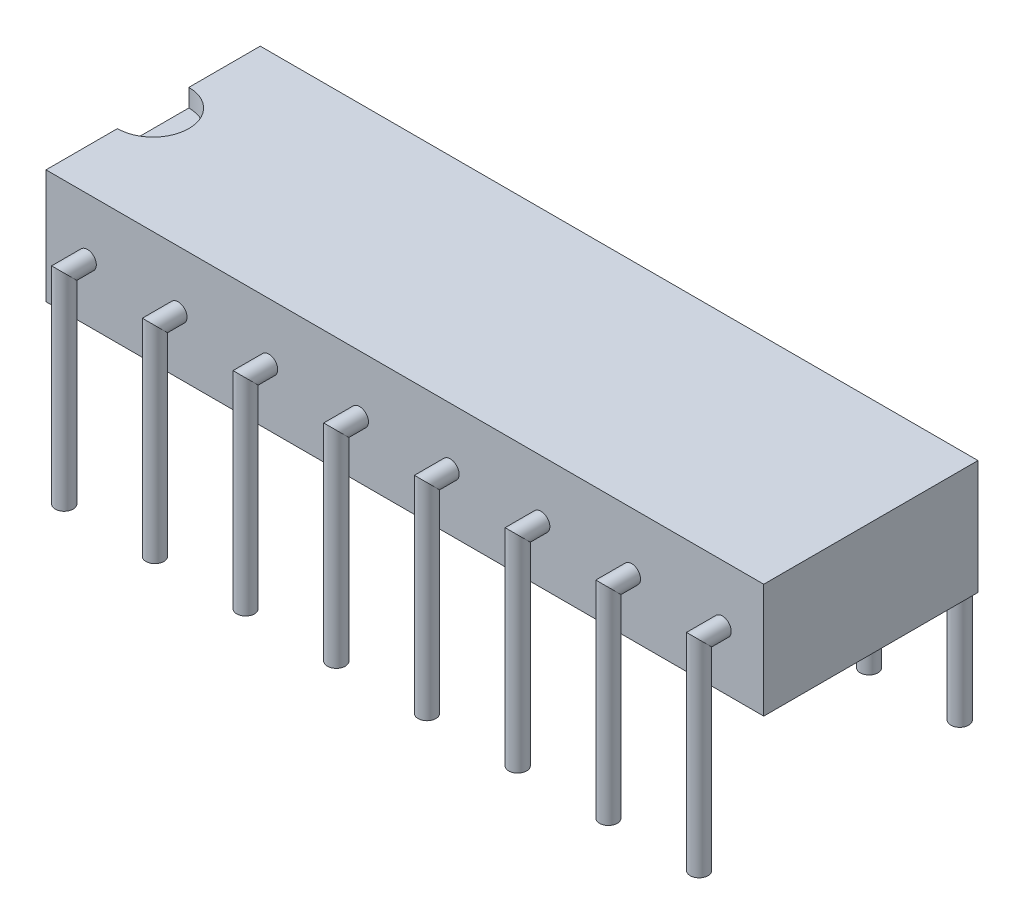
ISO-10303-21;
HEADER;
FILE_DESCRIPTION(('STEP AP214'),'2;1');
FILE_NAME('part.step','',(''),(''),'','','');
FILE_SCHEMA(('AUTOMOTIVE_DESIGN { 1 0 10303 214 1 1 1 1 }'));
ENDSEC;
DATA;
#1=APPLICATION_CONTEXT('core data for automotive mechanical design processes');
#2=APPLICATION_PROTOCOL_DEFINITION('international standard','automotive_design',2000,#1);
#3=PRODUCT_CONTEXT('',#1,'mechanical');
#4=PRODUCT('Part','Part','',(#3));
#5=PRODUCT_RELATED_PRODUCT_CATEGORY('part','',(#4));
#6=PRODUCT_DEFINITION_FORMATION('','',#4);
#7=PRODUCT_DEFINITION_CONTEXT('part definition',#1,'design');
#8=PRODUCT_DEFINITION('design','',#6,#7);
#9=PRODUCT_DEFINITION_SHAPE('','',#8);
#10=(LENGTH_UNIT() NAMED_UNIT(*) SI_UNIT(.MILLI.,.METRE.));
#11=(NAMED_UNIT(*) PLANE_ANGLE_UNIT() SI_UNIT($,.RADIAN.));
#12=(NAMED_UNIT(*) SI_UNIT($,.STERADIAN.) SOLID_ANGLE_UNIT());
#13=UNCERTAINTY_MEASURE_WITH_UNIT(LENGTH_MEASURE(1.E-05),#10,'distance_accuracy_value','');
#14=(GEOMETRIC_REPRESENTATION_CONTEXT(3) GLOBAL_UNCERTAINTY_ASSIGNED_CONTEXT((#13)) GLOBAL_UNIT_ASSIGNED_CONTEXT((#10,
#11,#12)) REPRESENTATION_CONTEXT('',''));
#15=CARTESIAN_POINT('',(0.,0.,0.));
#16=DIRECTION('',(0.,0.,1.));
#17=DIRECTION('',(1.,0.,0.));
#18=AXIS2_PLACEMENT_3D('',#15,#16,#17);
#19=CARTESIAN_POINT('',(20.1,3.2,3.));
#20=DIRECTION('',(0.,0.,-1.));
#21=DIRECTION('',(-1.,0.,0.));
#22=AXIS2_PLACEMENT_3D('',#19,#20,#21);
#23=PLANE('',#22);
#24=CARTESIAN_POINT('',(16.4,1.6,3.));
#25=DIRECTION('',(0.,0.,-1.));
#26=DIRECTION('',(-1.,0.,0.));
#27=AXIS2_PLACEMENT_3D('',#24,#25,#26);
#28=CIRCLE('',#27,0.25);
#29=CARTESIAN_POINT('',(16.15,1.6,3.));
#30=VERTEX_POINT('',#29);
#31=EDGE_CURVE('E51',#30,#30,#28,.F.);
#32=ORIENTED_EDGE('',*,*,#31,.F.);
#33=EDGE_LOOP('',(#32));
#34=FACE_BOUND('',#33,.T.);
#35=CARTESIAN_POINT('',(11.32,1.6,3.));
#36=DIRECTION('',(0.,0.,-1.));
#37=DIRECTION('',(-1.,0.,0.));
#38=AXIS2_PLACEMENT_3D('',#35,#36,#37);
#39=CIRCLE('',#38,0.25);
#40=CARTESIAN_POINT('',(11.07,1.6,3.));
#41=VERTEX_POINT('',#40);
#42=EDGE_CURVE('E154',#41,#41,#39,.F.);
#43=ORIENTED_EDGE('',*,*,#42,.F.);
#44=EDGE_LOOP('',(#43));
#45=FACE_BOUND('',#44,.T.);
#46=CARTESIAN_POINT('',(6.24,1.6,3.));
#47=DIRECTION('',(0.,0.,-1.));
#48=DIRECTION('',(-1.,0.,0.));
#49=AXIS2_PLACEMENT_3D('',#46,#47,#48);
#50=CIRCLE('',#49,0.25);
#51=CARTESIAN_POINT('',(5.99,1.6,3.));
#52=VERTEX_POINT('',#51);
#53=EDGE_CURVE('E148',#52,#52,#50,.F.);
#54=ORIENTED_EDGE('',*,*,#53,.F.);
#55=EDGE_LOOP('',(#54));
#56=FACE_BOUND('',#55,.T.);
#57=CARTESIAN_POINT('',(1.16,1.6,3.));
#58=DIRECTION('',(0.,0.,-1.));
#59=DIRECTION('',(-1.,0.,0.));
#60=AXIS2_PLACEMENT_3D('',#57,#58,#59);
#61=CIRCLE('',#60,0.25);
#62=CARTESIAN_POINT('',(0.91,1.6,3.));
#63=VERTEX_POINT('',#62);
#64=EDGE_CURVE('E142',#63,#63,#61,.F.);
#65=ORIENTED_EDGE('',*,*,#64,.F.);
#66=EDGE_LOOP('',(#65));
#67=FACE_BOUND('',#66,.T.);
#68=DIRECTION('',(0.,-1.,0.));
#69=VECTOR('',#68,1.);
#70=CARTESIAN_POINT('',(0.,3.2,3.));
#71=LINE('',#70,#69);
#72=CARTESIAN_POINT('',(0.,3.2,3.));
#73=VERTEX_POINT('',#72);
#74=CARTESIAN_POINT('',(0.,0.,3.));
#75=VERTEX_POINT('',#74);
#76=EDGE_CURVE('E178',#73,#75,#71,.T.);
#77=ORIENTED_EDGE('',*,*,#76,.T.);
#78=DIRECTION('',(-1.,0.,0.));
#79=VECTOR('',#78,1.);
#80=CARTESIAN_POINT('',(20.1,0.,3.));
#81=LINE('',#80,#79);
#82=CARTESIAN_POINT('',(20.1,0.,3.));
#83=VERTEX_POINT('',#82);
#84=EDGE_CURVE('E139',#83,#75,#81,.T.);
#85=ORIENTED_EDGE('',*,*,#84,.F.);
#86=DIRECTION('',(0.,-1.,0.));
#87=VECTOR('',#86,1.);
#88=CARTESIAN_POINT('',(20.1,3.2,3.));
#89=LINE('',#88,#87);
#90=CARTESIAN_POINT('',(20.1,3.2,3.));
#91=VERTEX_POINT('',#90);
#92=EDGE_CURVE('E119',#91,#83,#89,.T.);
#93=ORIENTED_EDGE('',*,*,#92,.F.);
#94=DIRECTION('',(-1.,0.,0.));
#95=VECTOR('',#94,1.);
#96=CARTESIAN_POINT('',(20.1,3.2,3.));
#97=LINE('',#96,#95);
#98=EDGE_CURVE('E132',#91,#73,#97,.T.);
#99=ORIENTED_EDGE('',*,*,#98,.T.);
#100=EDGE_LOOP('',(#77,#85,#93,#99));
#101=FACE_BOUND('',#100,.T.);
#102=CARTESIAN_POINT('',(3.7,1.6,3.));
#103=DIRECTION('',(0.,0.,-1.));
#104=DIRECTION('',(-1.,0.,0.));
#105=AXIS2_PLACEMENT_3D('',#102,#103,#104);
#106=CIRCLE('',#105,0.25);
#107=CARTESIAN_POINT('',(3.45,1.6,3.));
#108=VERTEX_POINT('',#107);
#109=EDGE_CURVE('E145',#108,#108,#106,.F.);
#110=ORIENTED_EDGE('',*,*,#109,.F.);
#111=EDGE_LOOP('',(#110));
#112=FACE_BOUND('',#111,.T.);
#113=CARTESIAN_POINT('',(8.78,1.6,3.));
#114=DIRECTION('',(0.,0.,-1.));
#115=DIRECTION('',(-1.,0.,0.));
#116=AXIS2_PLACEMENT_3D('',#113,#114,#115);
#117=CIRCLE('',#116,0.25);
#118=CARTESIAN_POINT('',(8.53,1.6,3.));
#119=VERTEX_POINT('',#118);
#120=EDGE_CURVE('E151',#119,#119,#117,.F.);
#121=ORIENTED_EDGE('',*,*,#120,.F.);
#122=EDGE_LOOP('',(#121));
#123=FACE_BOUND('',#122,.T.);
#124=CARTESIAN_POINT('',(13.86,1.6,3.));
#125=DIRECTION('',(0.,0.,-1.));
#126=DIRECTION('',(-1.,0.,0.));
#127=AXIS2_PLACEMENT_3D('',#124,#125,#126);
#128=CIRCLE('',#127,0.25);
#129=CARTESIAN_POINT('',(13.61,1.6,3.));
#130=VERTEX_POINT('',#129);
#131=EDGE_CURVE('E157',#130,#130,#128,.F.);
#132=ORIENTED_EDGE('',*,*,#131,.F.);
#133=EDGE_LOOP('',(#132));
#134=FACE_BOUND('',#133,.T.);
#135=CARTESIAN_POINT('',(18.94,1.6,3.));
#136=DIRECTION('',(0.,0.,-1.));
#137=DIRECTION('',(-1.,0.,0.));
#138=AXIS2_PLACEMENT_3D('',#135,#136,#137);
#139=CIRCLE('',#138,0.25);
#140=CARTESIAN_POINT('',(18.69,1.6,3.));
#141=VERTEX_POINT('',#140);
#142=EDGE_CURVE('E12',#141,#141,#139,.F.);
#143=ORIENTED_EDGE('',*,*,#142,.F.);
#144=EDGE_LOOP('',(#143));
#145=FACE_BOUND('',#144,.T.);
#146=ADVANCED_FACE('F44',(#34,#45,#56,#67,#101,#112,#123,#134,#145),#23,.F.);
#147=CARTESIAN_POINT('',(20.1,0.,3.));
#148=DIRECTION('',(0.,1.,0.));
#149=DIRECTION('',(0.,0.,1.));
#150=AXIS2_PLACEMENT_3D('',#147,#148,#149);
#151=PLANE('',#150);
#152=DIRECTION('',(0.,0.,-1.));
#153=VECTOR('',#152,1.);
#154=CARTESIAN_POINT('',(0.,0.,3.));
#155=LINE('',#154,#153);
#156=CARTESIAN_POINT('',(0.,0.,-3.));
#157=VERTEX_POINT('',#156);
#158=EDGE_CURVE('E260',#75,#157,#155,.T.);
#159=ORIENTED_EDGE('',*,*,#158,.T.);
#160=DIRECTION('',(-1.,0.,0.));
#161=VECTOR('',#160,1.);
#162=CARTESIAN_POINT('',(20.1,0.,-3.));
#163=LINE('',#162,#161);
#164=CARTESIAN_POINT('',(20.1,0.,-3.));
#165=VERTEX_POINT('',#164);
#166=EDGE_CURVE('E136',#165,#157,#163,.T.);
#167=ORIENTED_EDGE('',*,*,#166,.F.);
#168=DIRECTION('',(0.,0.,-1.));
#169=VECTOR('',#168,1.);
#170=CARTESIAN_POINT('',(20.1,0.,3.));
#171=LINE('',#170,#169);
#172=EDGE_CURVE('E122',#83,#165,#171,.T.);
#173=ORIENTED_EDGE('',*,*,#172,.F.);
#174=ORIENTED_EDGE('',*,*,#84,.T.);
#175=EDGE_LOOP('',(#159,#167,#173,#174));
#176=FACE_BOUND('',#175,.T.);
#177=ADVANCED_FACE('F167',(#176),#151,.F.);
#178=CARTESIAN_POINT('',(20.1,3.2,-3.));
#179=DIRECTION('',(0.,0.,1.));
#180=DIRECTION('',(1.,0.,0.));
#181=AXIS2_PLACEMENT_3D('',#178,#179,#180);
#182=PLANE('',#181);
#183=CARTESIAN_POINT('',(18.94,1.6,-3.));
#184=DIRECTION('',(0.,0.,1.));
#185=DIRECTION('',(1.,0.,0.));
#186=AXIS2_PLACEMENT_3D('',#183,#184,#185);
#187=CIRCLE('',#186,0.25);
#188=CARTESIAN_POINT('',(19.19,1.6,-3.));
#189=VERTEX_POINT('',#188);
#190=EDGE_CURVE('E701',#189,#189,#187,.T.);
#191=ORIENTED_EDGE('',*,*,#190,.T.);
#192=EDGE_LOOP('',(#191));
#193=FACE_BOUND('',#192,.T.);
#194=CARTESIAN_POINT('',(16.4,1.6,-3.));
#195=DIRECTION('',(0.,0.,1.));
#196=DIRECTION('',(1.,0.,0.));
#197=AXIS2_PLACEMENT_3D('',#194,#195,#196);
#198=CIRCLE('',#197,0.25);
#199=CARTESIAN_POINT('',(16.65,1.6,-3.));
#200=VERTEX_POINT('',#199);
#201=EDGE_CURVE('E694',#200,#200,#198,.T.);
#202=ORIENTED_EDGE('',*,*,#201,.T.);
#203=EDGE_LOOP('',(#202));
#204=FACE_BOUND('',#203,.T.);
#205=CARTESIAN_POINT('',(13.86,1.6,-3.));
#206=DIRECTION('',(0.,0.,1.));
#207=DIRECTION('',(1.,0.,0.));
#208=AXIS2_PLACEMENT_3D('',#205,#206,#207);
#209=CIRCLE('',#208,0.25);
#210=CARTESIAN_POINT('',(14.11,1.6,-3.));
#211=VERTEX_POINT('',#210);
#212=EDGE_CURVE('E710',#211,#211,#209,.T.);
#213=ORIENTED_EDGE('',*,*,#212,.T.);
#214=EDGE_LOOP('',(#213));
#215=FACE_BOUND('',#214,.T.);
#216=CARTESIAN_POINT('',(11.32,1.6,-3.));
#217=DIRECTION('',(0.,0.,1.));
#218=DIRECTION('',(1.,0.,0.));
#219=AXIS2_PLACEMENT_3D('',#216,#217,#218);
#220=CIRCLE('',#219,0.25);
#221=CARTESIAN_POINT('',(11.57,1.6,-3.));
#222=VERTEX_POINT('',#221);
#223=EDGE_CURVE('E719',#222,#222,#220,.T.);
#224=ORIENTED_EDGE('',*,*,#223,.T.);
#225=EDGE_LOOP('',(#224));
#226=FACE_BOUND('',#225,.T.);
#227=CARTESIAN_POINT('',(8.78,1.6,-3.));
#228=DIRECTION('',(0.,0.,1.));
#229=DIRECTION('',(1.,0.,0.));
#230=AXIS2_PLACEMENT_3D('',#227,#228,#229);
#231=CIRCLE('',#230,0.25);
#232=CARTESIAN_POINT('',(9.03,1.6,-3.));
#233=VERTEX_POINT('',#232);
#234=EDGE_CURVE('E728',#233,#233,#231,.T.);
#235=ORIENTED_EDGE('',*,*,#234,.T.);
#236=EDGE_LOOP('',(#235));
#237=FACE_BOUND('',#236,.T.);
#238=CARTESIAN_POINT('',(6.24,1.6,-3.));
#239=DIRECTION('',(0.,0.,1.));
#240=DIRECTION('',(1.,0.,0.));
#241=AXIS2_PLACEMENT_3D('',#238,#239,#240);
#242=CIRCLE('',#241,0.25);
#243=CARTESIAN_POINT('',(6.49,1.6,-3.));
#244=VERTEX_POINT('',#243);
#245=EDGE_CURVE('E737',#244,#244,#242,.T.);
#246=ORIENTED_EDGE('',*,*,#245,.T.);
#247=EDGE_LOOP('',(#246));
#248=FACE_BOUND('',#247,.T.);
#249=CARTESIAN_POINT('',(3.7,1.6,-3.));
#250=DIRECTION('',(0.,0.,1.));
#251=DIRECTION('',(1.,0.,0.));
#252=AXIS2_PLACEMENT_3D('',#249,#250,#251);
#253=CIRCLE('',#252,0.25);
#254=CARTESIAN_POINT('',(3.95,1.6,-3.));
#255=VERTEX_POINT('',#254);
#256=EDGE_CURVE('E746',#255,#255,#253,.T.);
#257=ORIENTED_EDGE('',*,*,#256,.T.);
#258=EDGE_LOOP('',(#257));
#259=FACE_BOUND('',#258,.T.);
#260=CARTESIAN_POINT('',(1.16,1.6,-3.));
#261=DIRECTION('',(0.,0.,1.));
#262=DIRECTION('',(1.,0.,0.));
#263=AXIS2_PLACEMENT_3D('',#260,#261,#262);
#264=CIRCLE('',#263,0.25);
#265=CARTESIAN_POINT('',(1.41,1.6,-3.));
#266=VERTEX_POINT('',#265);
#267=EDGE_CURVE('E243',#266,#266,#264,.T.);
#268=ORIENTED_EDGE('',*,*,#267,.T.);
#269=EDGE_LOOP('',(#268));
#270=FACE_BOUND('',#269,.T.);
#271=DIRECTION('',(0.,1.,0.));
#272=VECTOR('',#271,1.);
#273=CARTESIAN_POINT('',(0.,3.2,-3.));
#274=LINE('',#273,#272);
#275=CARTESIAN_POINT('',(0.,3.2,-3.));
#276=VERTEX_POINT('',#275);
#277=EDGE_CURVE('E124',#157,#276,#274,.T.);
#278=ORIENTED_EDGE('',*,*,#277,.T.);
#279=DIRECTION('',(-1.,0.,0.));
#280=VECTOR('',#279,1.);
#281=CARTESIAN_POINT('',(20.1,3.2,-3.));
#282=LINE('',#281,#280);
#283=CARTESIAN_POINT('',(20.1,3.2,-3.));
#284=VERTEX_POINT('',#283);
#285=EDGE_CURVE('E118',#284,#276,#282,.T.);
#286=ORIENTED_EDGE('',*,*,#285,.F.);
#287=DIRECTION('',(0.,1.,0.));
#288=VECTOR('',#287,1.);
#289=CARTESIAN_POINT('',(20.1,3.2,-3.));
#290=LINE('',#289,#288);
#291=EDGE_CURVE('E129',#165,#284,#290,.T.);
#292=ORIENTED_EDGE('',*,*,#291,.F.);
#293=ORIENTED_EDGE('',*,*,#166,.T.);
#294=EDGE_LOOP('',(#278,#286,#292,#293));
#295=FACE_BOUND('',#294,.T.);
#296=ADVANCED_FACE('F264',(#193,#204,#215,#226,#237,#248,#259,#270,#295),#182,.F.);
#297=CARTESIAN_POINT('',(20.1,3.2,3.));
#298=DIRECTION('',(0.,-1.,0.));
#299=DIRECTION('',(0.,0.,-1.));
#300=AXIS2_PLACEMENT_3D('',#297,#298,#299);
#301=PLANE('',#300);
#302=DIRECTION('',(0.,0.,1.));
#303=VECTOR('',#302,1.);
#304=CARTESIAN_POINT('',(0.,3.2,3.));
#305=LINE('',#304,#303);
#306=CARTESIAN_POINT('',(0.,3.2,-1.));
#307=VERTEX_POINT('',#306);
#308=EDGE_CURVE('E112',#276,#307,#305,.T.);
#309=ORIENTED_EDGE('',*,*,#308,.T.);
#310=CARTESIAN_POINT('',(0.,3.2,0.));
#311=DIRECTION('',(0.,1.,0.));
#312=DIRECTION('',(0.,0.,1.));
#313=AXIS2_PLACEMENT_3D('',#310,#311,#312);
#314=CIRCLE('',#313,1.);
#315=CARTESIAN_POINT('',(0.,3.2,1.));
#316=VERTEX_POINT('',#315);
#317=EDGE_CURVE('E96',#316,#307,#314,.T.);
#318=ORIENTED_EDGE('',*,*,#317,.F.);
#319=EDGE_CURVE('E120',#316,#73,#305,.T.);
#320=ORIENTED_EDGE('',*,*,#319,.T.);
#321=ORIENTED_EDGE('',*,*,#98,.F.);
#322=DIRECTION('',(0.,0.,1.));
#323=VECTOR('',#322,1.);
#324=CARTESIAN_POINT('',(20.1,3.2,3.));
#325=LINE('',#324,#323);
#326=EDGE_CURVE('E65',#284,#91,#325,.T.);
#327=ORIENTED_EDGE('',*,*,#326,.F.);
#328=ORIENTED_EDGE('',*,*,#285,.T.);
#329=EDGE_LOOP('',(#309,#318,#320,#321,#327,#328));
#330=FACE_BOUND('',#329,.T.);
#331=ADVANCED_FACE('F116',(#330),#301,.F.);
#332=CARTESIAN_POINT('',(20.1,0.,3.));
#333=DIRECTION('',(1.,0.,0.));
#334=DIRECTION('',(0.,0.,-1.));
#335=AXIS2_PLACEMENT_3D('',#332,#333,#334);
#336=PLANE('',#335);
#337=ORIENTED_EDGE('',*,*,#92,.T.);
#338=ORIENTED_EDGE('',*,*,#172,.T.);
#339=ORIENTED_EDGE('',*,*,#291,.T.);
#340=ORIENTED_EDGE('',*,*,#326,.T.);
#341=EDGE_LOOP('',(#337,#338,#339,#340));
#342=FACE_BOUND('',#341,.T.);
#343=ADVANCED_FACE('F267',(#342),#336,.T.);
#344=CARTESIAN_POINT('',(0.,0.,3.));
#345=DIRECTION('',(1.,0.,0.));
#346=DIRECTION('',(0.,0.,-1.));
#347=AXIS2_PLACEMENT_3D('',#344,#345,#346);
#348=PLANE('',#347);
#349=DIRECTION('',(0.,0.,1.));
#350=VECTOR('',#349,1.);
#351=CARTESIAN_POINT('',(0.,2.7,-1.));
#352=LINE('',#351,#350);
#353=CARTESIAN_POINT('',(0.,2.7,-1.));
#354=VERTEX_POINT('',#353);
#355=CARTESIAN_POINT('',(0.,2.7,1.));
#356=VERTEX_POINT('',#355);
#357=EDGE_CURVE('E113',#354,#356,#352,.T.);
#358=ORIENTED_EDGE('',*,*,#357,.F.);
#359=DIRECTION('',(0.,1.,0.));
#360=VECTOR('',#359,1.);
#361=CARTESIAN_POINT('',(0.,2.7,-1.));
#362=LINE('',#361,#360);
#363=EDGE_CURVE('E99',#354,#307,#362,.T.);
#364=ORIENTED_EDGE('',*,*,#363,.T.);
#365=ORIENTED_EDGE('',*,*,#308,.F.);
#366=ORIENTED_EDGE('',*,*,#277,.F.);
#367=ORIENTED_EDGE('',*,*,#158,.F.);
#368=ORIENTED_EDGE('',*,*,#76,.F.);
#369=ORIENTED_EDGE('',*,*,#319,.F.);
#370=DIRECTION('',(0.,1.,0.));
#371=VECTOR('',#370,1.);
#372=CARTESIAN_POINT('',(0.,2.7,1.));
#373=LINE('',#372,#371);
#374=EDGE_CURVE('E102',#356,#316,#373,.T.);
#375=ORIENTED_EDGE('',*,*,#374,.F.);
#376=EDGE_LOOP('',(#358,#364,#365,#366,#367,#368,#369,#375));
#377=FACE_BOUND('',#376,.T.);
#378=ADVANCED_FACE('F110',(#377),#348,.F.);
#379=CARTESIAN_POINT('',(0.,2.7,0.));
#380=DIRECTION('',(0.,1.,0.));
#381=DIRECTION('',(0.,0.,1.));
#382=AXIS2_PLACEMENT_3D('',#379,#380,#381);
#383=CYLINDRICAL_SURFACE('',#382,1.);
#384=ORIENTED_EDGE('',*,*,#317,.T.);
#385=ORIENTED_EDGE('',*,*,#363,.F.);
#386=CARTESIAN_POINT('',(0.,2.7,0.));
#387=DIRECTION('',(0.,1.,0.));
#388=DIRECTION('',(0.,0.,1.));
#389=AXIS2_PLACEMENT_3D('',#386,#387,#388);
#390=CIRCLE('',#389,1.);
#391=EDGE_CURVE('E57',#356,#354,#390,.T.);
#392=ORIENTED_EDGE('',*,*,#391,.F.);
#393=ORIENTED_EDGE('',*,*,#374,.T.);
#394=EDGE_LOOP('',(#384,#385,#392,#393));
#395=FACE_BOUND('',#394,.T.);
#396=ADVANCED_FACE('F98',(#395),#383,.F.);
#397=CARTESIAN_POINT('',(0.,2.7,0.));
#398=DIRECTION('',(0.,1.,0.));
#399=DIRECTION('',(0.,0.,1.));
#400=AXIS2_PLACEMENT_3D('',#397,#398,#399);
#401=PLANE('',#400);
#402=ORIENTED_EDGE('',*,*,#391,.T.);
#403=ORIENTED_EDGE('',*,*,#357,.T.);
#404=EDGE_LOOP('',(#402,#403));
#405=FACE_BOUND('',#404,.T.);
#406=ADVANCED_FACE('F305',(#405),#401,.T.);
#407=CARTESIAN_POINT('',(1.16,1.6,3.65));
#408=DIRECTION('',(0.,-1.,0.));
#409=DIRECTION('',(0.,0.,-1.));
#410=AXIS2_PLACEMENT_3D('',#407,#408,#409);
#411=CYLINDRICAL_SURFACE('',#410,0.25);
#412=CARTESIAN_POINT('',(1.16,1.6,3.65));
#413=DIRECTION('',(0.,-0.707106781186548,0.707106781186547));
#414=DIRECTION('',(0.,-0.707106781186547,-0.707106781186548));
#415=AXIS2_PLACEMENT_3D('',#412,#413,#414);
#416=ELLIPSE('',#415,0.353553390593274,0.25);
#417=CARTESIAN_POINT('',(1.16,1.35,3.4));
#418=VERTEX_POINT('',#417);
#419=EDGE_CURVE('E252',#418,#418,#416,.T.);
#420=ORIENTED_EDGE('',*,*,#419,.T.);
#421=EDGE_LOOP('',(#420));
#422=FACE_BOUND('',#421,.T.);
#423=CARTESIAN_POINT('',(1.16,-4.,3.65));
#424=DIRECTION('',(0.,-1.,0.));
#425=DIRECTION('',(0.,0.,-1.));
#426=AXIS2_PLACEMENT_3D('',#423,#424,#425);
#427=CIRCLE('',#426,0.25);
#428=CARTESIAN_POINT('',(1.16,-4.,3.4));
#429=VERTEX_POINT('',#428);
#430=EDGE_CURVE('E106',#429,#429,#427,.F.);
#431=ORIENTED_EDGE('',*,*,#430,.T.);
#432=EDGE_LOOP('',(#431));
#433=FACE_BOUND('',#432,.T.);
#434=ADVANCED_FACE('F311',(#422,#433),#411,.T.);
#435=CARTESIAN_POINT('',(1.16,1.6,4.35710678118655));
#436=DIRECTION('',(0.,0.,-1.));
#437=DIRECTION('',(0.,1.,0.));
#438=AXIS2_PLACEMENT_3D('',#435,#436,#437);
#439=CYLINDRICAL_SURFACE('',#438,0.25);
#440=ORIENTED_EDGE('',*,*,#64,.T.);
#441=EDGE_LOOP('',(#440));
#442=FACE_BOUND('',#441,.T.);
#443=ORIENTED_EDGE('',*,*,#419,.F.);
#444=EDGE_LOOP('',(#443));
#445=FACE_BOUND('',#444,.T.);
#446=ADVANCED_FACE('F318',(#442,#445),#439,.T.);
#447=CARTESIAN_POINT('',(1.16,-4.,3.65));
#448=DIRECTION('',(0.,-1.,0.));
#449=DIRECTION('',(0.,0.,-1.));
#450=AXIS2_PLACEMENT_3D('',#447,#448,#449);
#451=PLANE('',#450);
#452=ORIENTED_EDGE('',*,*,#430,.F.);
#453=EDGE_LOOP('',(#452));
#454=FACE_BOUND('',#453,.T.);
#455=ADVANCED_FACE('F326',(#454),#451,.T.);
#456=CARTESIAN_POINT('',(1.16,1.6,-3.65));
#457=DIRECTION('',(0.,-1.,0.));
#458=DIRECTION('',(0.,0.,-1.));
#459=AXIS2_PLACEMENT_3D('',#456,#457,#458);
#460=CYLINDRICAL_SURFACE('',#459,0.25);
#461=CARTESIAN_POINT('',(1.16,1.6,-3.65));
#462=DIRECTION('',(0.,-0.707106781186548,-0.707106781186547));
#463=DIRECTION('',(0.,-0.707106781186547,0.707106781186548));
#464=AXIS2_PLACEMENT_3D('',#461,#462,#463);
#465=ELLIPSE('',#464,0.353553390593274,0.25);
#466=CARTESIAN_POINT('',(1.16,1.35,-3.4));
#467=VERTEX_POINT('',#466);
#468=EDGE_CURVE('E246',#467,#467,#465,.F.);
#469=ORIENTED_EDGE('',*,*,#468,.F.);
#470=EDGE_LOOP('',(#469));
#471=FACE_BOUND('',#470,.T.);
#472=CARTESIAN_POINT('',(1.16,-4.,-3.65));
#473=DIRECTION('',(0.,-1.,0.));
#474=DIRECTION('',(0.,0.,-1.));
#475=AXIS2_PLACEMENT_3D('',#472,#473,#474);
#476=CIRCLE('',#475,0.25);
#477=CARTESIAN_POINT('',(1.16,-4.,-3.9));
#478=VERTEX_POINT('',#477);
#479=EDGE_CURVE('E249',#478,#478,#476,.T.);
#480=ORIENTED_EDGE('',*,*,#479,.F.);
#481=EDGE_LOOP('',(#480));
#482=FACE_BOUND('',#481,.T.);
#483=ADVANCED_FACE('F334',(#471,#482),#460,.T.);
#484=CARTESIAN_POINT('',(1.16,1.6,-4.35710678118655));
#485=DIRECTION('',(0.,0.,1.));
#486=DIRECTION('',(0.,-1.,0.));
#487=AXIS2_PLACEMENT_3D('',#484,#485,#486);
#488=CYLINDRICAL_SURFACE('',#487,0.25);
#489=ORIENTED_EDGE('',*,*,#267,.F.);
#490=EDGE_LOOP('',(#489));
#491=FACE_BOUND('',#490,.T.);
#492=ORIENTED_EDGE('',*,*,#468,.T.);
#493=EDGE_LOOP('',(#492));
#494=FACE_BOUND('',#493,.T.);
#495=ADVANCED_FACE('F342',(#491,#494),#488,.T.);
#496=CARTESIAN_POINT('',(1.16,-4.,-3.65));
#497=DIRECTION('',(0.,-1.,0.));
#498=DIRECTION('',(0.,0.,-1.));
#499=AXIS2_PLACEMENT_3D('',#496,#497,#498);
#500=PLANE('',#499);
#501=ORIENTED_EDGE('',*,*,#479,.T.);
#502=EDGE_LOOP('',(#501));
#503=FACE_BOUND('',#502,.T.);
#504=ADVANCED_FACE('F350',(#503),#500,.T.);
#505=CARTESIAN_POINT('',(3.7,1.6,3.65));
#506=DIRECTION('',(0.,-1.,0.));
#507=DIRECTION('',(0.,0.,-1.));
#508=AXIS2_PLACEMENT_3D('',#505,#506,#507);
#509=CYLINDRICAL_SURFACE('',#508,0.25);
#510=CARTESIAN_POINT('',(3.7,1.6,3.65));
#511=DIRECTION('',(0.,-0.707106781186548,0.707106781186547));
#512=DIRECTION('',(0.,-0.707106781186547,-0.707106781186548));
#513=AXIS2_PLACEMENT_3D('',#510,#511,#512);
#514=ELLIPSE('',#513,0.353553390593274,0.25);
#515=CARTESIAN_POINT('',(3.7,1.35,3.4));
#516=VERTEX_POINT('',#515);
#517=EDGE_CURVE('E237',#516,#516,#514,.T.);
#518=ORIENTED_EDGE('',*,*,#517,.T.);
#519=EDGE_LOOP('',(#518));
#520=FACE_BOUND('',#519,.T.);
#521=CARTESIAN_POINT('',(3.7,-4.,3.65));
#522=DIRECTION('',(0.,-1.,0.));
#523=DIRECTION('',(0.,0.,-1.));
#524=AXIS2_PLACEMENT_3D('',#521,#522,#523);
#525=CIRCLE('',#524,0.25);
#526=CARTESIAN_POINT('',(3.7,-4.,3.4));
#527=VERTEX_POINT('',#526);
#528=EDGE_CURVE('E240',#527,#527,#525,.F.);
#529=ORIENTED_EDGE('',*,*,#528,.T.);
#530=EDGE_LOOP('',(#529));
#531=FACE_BOUND('',#530,.T.);
#532=ADVANCED_FACE('F358',(#520,#531),#509,.T.);
#533=CARTESIAN_POINT('',(3.7,1.6,4.35710678118655));
#534=DIRECTION('',(0.,0.,-1.));
#535=DIRECTION('',(0.,1.,0.));
#536=AXIS2_PLACEMENT_3D('',#533,#534,#535);
#537=CYLINDRICAL_SURFACE('',#536,0.25);
#538=ORIENTED_EDGE('',*,*,#109,.T.);
#539=EDGE_LOOP('',(#538));
#540=FACE_BOUND('',#539,.T.);
#541=ORIENTED_EDGE('',*,*,#517,.F.);
#542=EDGE_LOOP('',(#541));
#543=FACE_BOUND('',#542,.T.);
#544=ADVANCED_FACE('F369',(#540,#543),#537,.T.);
#545=CARTESIAN_POINT('',(3.7,-4.,3.65));
#546=DIRECTION('',(0.,-1.,0.));
#547=DIRECTION('',(0.,0.,-1.));
#548=AXIS2_PLACEMENT_3D('',#545,#546,#547);
#549=PLANE('',#548);
#550=ORIENTED_EDGE('',*,*,#528,.F.);
#551=EDGE_LOOP('',(#550));
#552=FACE_BOUND('',#551,.T.);
#553=ADVANCED_FACE('F377',(#552),#549,.T.);
#554=CARTESIAN_POINT('',(6.24,1.6,3.65));
#555=DIRECTION('',(0.,-1.,0.));
#556=DIRECTION('',(0.,0.,-1.));
#557=AXIS2_PLACEMENT_3D('',#554,#555,#556);
#558=CYLINDRICAL_SURFACE('',#557,0.25);
#559=CARTESIAN_POINT('',(6.24,1.6,3.65));
#560=DIRECTION('',(0.,-0.707106781186548,0.707106781186547));
#561=DIRECTION('',(0.,-0.707106781186547,-0.707106781186548));
#562=AXIS2_PLACEMENT_3D('',#559,#560,#561);
#563=ELLIPSE('',#562,0.353553390593274,0.25);
#564=CARTESIAN_POINT('',(6.24,1.35,3.4));
#565=VERTEX_POINT('',#564);
#566=EDGE_CURVE('E231',#565,#565,#563,.T.);
#567=ORIENTED_EDGE('',*,*,#566,.T.);
#568=EDGE_LOOP('',(#567));
#569=FACE_BOUND('',#568,.T.);
#570=CARTESIAN_POINT('',(6.24,-4.,3.65));
#571=DIRECTION('',(0.,-1.,0.));
#572=DIRECTION('',(0.,0.,-1.));
#573=AXIS2_PLACEMENT_3D('',#570,#571,#572);
#574=CIRCLE('',#573,0.25);
#575=CARTESIAN_POINT('',(6.24,-4.,3.4));
#576=VERTEX_POINT('',#575);
#577=EDGE_CURVE('E234',#576,#576,#574,.F.);
#578=ORIENTED_EDGE('',*,*,#577,.T.);
#579=EDGE_LOOP('',(#578));
#580=FACE_BOUND('',#579,.T.);
#581=ADVANCED_FACE('F385',(#569,#580),#558,.T.);
#582=CARTESIAN_POINT('',(6.24,1.6,4.35710678118655));
#583=DIRECTION('',(0.,0.,-1.));
#584=DIRECTION('',(0.,1.,0.));
#585=AXIS2_PLACEMENT_3D('',#582,#583,#584);
#586=CYLINDRICAL_SURFACE('',#585,0.25);
#587=ORIENTED_EDGE('',*,*,#53,.T.);
#588=EDGE_LOOP('',(#587));
#589=FACE_BOUND('',#588,.T.);
#590=ORIENTED_EDGE('',*,*,#566,.F.);
#591=EDGE_LOOP('',(#590));
#592=FACE_BOUND('',#591,.T.);
#593=ADVANCED_FACE('F393',(#589,#592),#586,.T.);
#594=CARTESIAN_POINT('',(6.24,-4.,3.65));
#595=DIRECTION('',(0.,-1.,0.));
#596=DIRECTION('',(0.,0.,-1.));
#597=AXIS2_PLACEMENT_3D('',#594,#595,#596);
#598=PLANE('',#597);
#599=ORIENTED_EDGE('',*,*,#577,.F.);
#600=EDGE_LOOP('',(#599));
#601=FACE_BOUND('',#600,.T.);
#602=ADVANCED_FACE('F401',(#601),#598,.T.);
#603=CARTESIAN_POINT('',(8.78,1.6,3.65));
#604=DIRECTION('',(0.,-1.,0.));
#605=DIRECTION('',(0.,0.,-1.));
#606=AXIS2_PLACEMENT_3D('',#603,#604,#605);
#607=CYLINDRICAL_SURFACE('',#606,0.25);
#608=CARTESIAN_POINT('',(8.78,1.6,3.65));
#609=DIRECTION('',(0.,-0.707106781186548,0.707106781186547));
#610=DIRECTION('',(0.,-0.707106781186547,-0.707106781186548));
#611=AXIS2_PLACEMENT_3D('',#608,#609,#610);
#612=ELLIPSE('',#611,0.353553390593274,0.25);
#613=CARTESIAN_POINT('',(8.78,1.35,3.4));
#614=VERTEX_POINT('',#613);
#615=EDGE_CURVE('E225',#614,#614,#612,.T.);
#616=ORIENTED_EDGE('',*,*,#615,.T.);
#617=EDGE_LOOP('',(#616));
#618=FACE_BOUND('',#617,.T.);
#619=CARTESIAN_POINT('',(8.78,-4.,3.65));
#620=DIRECTION('',(0.,-1.,0.));
#621=DIRECTION('',(0.,0.,-1.));
#622=AXIS2_PLACEMENT_3D('',#619,#620,#621);
#623=CIRCLE('',#622,0.25);
#624=CARTESIAN_POINT('',(8.78,-4.,3.4));
#625=VERTEX_POINT('',#624);
#626=EDGE_CURVE('E228',#625,#625,#623,.F.);
#627=ORIENTED_EDGE('',*,*,#626,.T.);
#628=EDGE_LOOP('',(#627));
#629=FACE_BOUND('',#628,.T.);
#630=ADVANCED_FACE('F409',(#618,#629),#607,.T.);
#631=CARTESIAN_POINT('',(8.78,1.6,4.35710678118655));
#632=DIRECTION('',(0.,0.,-1.));
#633=DIRECTION('',(0.,1.,0.));
#634=AXIS2_PLACEMENT_3D('',#631,#632,#633);
#635=CYLINDRICAL_SURFACE('',#634,0.25);
#636=ORIENTED_EDGE('',*,*,#120,.T.);
#637=EDGE_LOOP('',(#636));
#638=FACE_BOUND('',#637,.T.);
#639=ORIENTED_EDGE('',*,*,#615,.F.);
#640=EDGE_LOOP('',(#639));
#641=FACE_BOUND('',#640,.T.);
#642=ADVANCED_FACE('F417',(#638,#641),#635,.T.);
#643=CARTESIAN_POINT('',(8.78,-4.,3.65));
#644=DIRECTION('',(0.,-1.,0.));
#645=DIRECTION('',(0.,0.,-1.));
#646=AXIS2_PLACEMENT_3D('',#643,#644,#645);
#647=PLANE('',#646);
#648=ORIENTED_EDGE('',*,*,#626,.F.);
#649=EDGE_LOOP('',(#648));
#650=FACE_BOUND('',#649,.T.);
#651=ADVANCED_FACE('F425',(#650),#647,.T.);
#652=CARTESIAN_POINT('',(11.32,1.6,3.65));
#653=DIRECTION('',(0.,-1.,0.));
#654=DIRECTION('',(0.,0.,-1.));
#655=AXIS2_PLACEMENT_3D('',#652,#653,#654);
#656=CYLINDRICAL_SURFACE('',#655,0.25);
#657=CARTESIAN_POINT('',(11.32,1.6,3.65));
#658=DIRECTION('',(0.,-0.707106781186548,0.707106781186547));
#659=DIRECTION('',(0.,-0.707106781186547,-0.707106781186548));
#660=AXIS2_PLACEMENT_3D('',#657,#658,#659);
#661=ELLIPSE('',#660,0.353553390593274,0.25);
#662=CARTESIAN_POINT('',(11.32,1.35,3.4));
#663=VERTEX_POINT('',#662);
#664=EDGE_CURVE('E219',#663,#663,#661,.T.);
#665=ORIENTED_EDGE('',*,*,#664,.T.);
#666=EDGE_LOOP('',(#665));
#667=FACE_BOUND('',#666,.T.);
#668=CARTESIAN_POINT('',(11.32,-4.,3.65));
#669=DIRECTION('',(0.,-1.,0.));
#670=DIRECTION('',(0.,0.,-1.));
#671=AXIS2_PLACEMENT_3D('',#668,#669,#670);
#672=CIRCLE('',#671,0.25);
#673=CARTESIAN_POINT('',(11.32,-4.,3.4));
#674=VERTEX_POINT('',#673);
#675=EDGE_CURVE('E222',#674,#674,#672,.F.);
#676=ORIENTED_EDGE('',*,*,#675,.T.);
#677=EDGE_LOOP('',(#676));
#678=FACE_BOUND('',#677,.T.);
#679=ADVANCED_FACE('F433',(#667,#678),#656,.T.);
#680=CARTESIAN_POINT('',(11.32,1.6,4.35710678118655));
#681=DIRECTION('',(0.,0.,-1.));
#682=DIRECTION('',(0.,1.,0.));
#683=AXIS2_PLACEMENT_3D('',#680,#681,#682);
#684=CYLINDRICAL_SURFACE('',#683,0.25);
#685=ORIENTED_EDGE('',*,*,#42,.T.);
#686=EDGE_LOOP('',(#685));
#687=FACE_BOUND('',#686,.T.);
#688=ORIENTED_EDGE('',*,*,#664,.F.);
#689=EDGE_LOOP('',(#688));
#690=FACE_BOUND('',#689,.T.);
#691=ADVANCED_FACE('F441',(#687,#690),#684,.T.);
#692=CARTESIAN_POINT('',(11.32,-4.,3.65));
#693=DIRECTION('',(0.,-1.,0.));
#694=DIRECTION('',(0.,0.,-1.));
#695=AXIS2_PLACEMENT_3D('',#692,#693,#694);
#696=PLANE('',#695);
#697=ORIENTED_EDGE('',*,*,#675,.F.);
#698=EDGE_LOOP('',(#697));
#699=FACE_BOUND('',#698,.T.);
#700=ADVANCED_FACE('F449',(#699),#696,.T.);
#701=CARTESIAN_POINT('',(13.86,1.6,3.65));
#702=DIRECTION('',(0.,-1.,0.));
#703=DIRECTION('',(0.,0.,-1.));
#704=AXIS2_PLACEMENT_3D('',#701,#702,#703);
#705=CYLINDRICAL_SURFACE('',#704,0.25);
#706=CARTESIAN_POINT('',(13.86,1.6,3.65));
#707=DIRECTION('',(0.,-0.707106781186548,0.707106781186547));
#708=DIRECTION('',(0.,-0.707106781186547,-0.707106781186548));
#709=AXIS2_PLACEMENT_3D('',#706,#707,#708);
#710=ELLIPSE('',#709,0.353553390593274,0.25);
#711=CARTESIAN_POINT('',(13.86,1.35,3.4));
#712=VERTEX_POINT('',#711);
#713=EDGE_CURVE('E213',#712,#712,#710,.T.);
#714=ORIENTED_EDGE('',*,*,#713,.T.);
#715=EDGE_LOOP('',(#714));
#716=FACE_BOUND('',#715,.T.);
#717=CARTESIAN_POINT('',(13.86,-4.,3.65));
#718=DIRECTION('',(0.,-1.,0.));
#719=DIRECTION('',(0.,0.,-1.));
#720=AXIS2_PLACEMENT_3D('',#717,#718,#719);
#721=CIRCLE('',#720,0.25);
#722=CARTESIAN_POINT('',(13.86,-4.,3.4));
#723=VERTEX_POINT('',#722);
#724=EDGE_CURVE('E216',#723,#723,#721,.F.);
#725=ORIENTED_EDGE('',*,*,#724,.T.);
#726=EDGE_LOOP('',(#725));
#727=FACE_BOUND('',#726,.T.);
#728=ADVANCED_FACE('F457',(#716,#727),#705,.T.);
#729=CARTESIAN_POINT('',(13.86,1.6,4.35710678118655));
#730=DIRECTION('',(0.,0.,-1.));
#731=DIRECTION('',(0.,1.,0.));
#732=AXIS2_PLACEMENT_3D('',#729,#730,#731);
#733=CYLINDRICAL_SURFACE('',#732,0.25);
#734=ORIENTED_EDGE('',*,*,#131,.T.);
#735=EDGE_LOOP('',(#734));
#736=FACE_BOUND('',#735,.T.);
#737=ORIENTED_EDGE('',*,*,#713,.F.);
#738=EDGE_LOOP('',(#737));
#739=FACE_BOUND('',#738,.T.);
#740=ADVANCED_FACE('F465',(#736,#739),#733,.T.);
#741=CARTESIAN_POINT('',(13.86,-4.,3.65));
#742=DIRECTION('',(0.,-1.,0.));
#743=DIRECTION('',(0.,0.,-1.));
#744=AXIS2_PLACEMENT_3D('',#741,#742,#743);
#745=PLANE('',#744);
#746=ORIENTED_EDGE('',*,*,#724,.F.);
#747=EDGE_LOOP('',(#746));
#748=FACE_BOUND('',#747,.T.);
#749=ADVANCED_FACE('F473',(#748),#745,.T.);
#750=CARTESIAN_POINT('',(16.4,1.6,3.65));
#751=DIRECTION('',(0.,-1.,0.));
#752=DIRECTION('',(0.,0.,-1.));
#753=AXIS2_PLACEMENT_3D('',#750,#751,#752);
#754=CYLINDRICAL_SURFACE('',#753,0.25);
#755=CARTESIAN_POINT('',(16.4,1.6,3.65));
#756=DIRECTION('',(0.,-0.707106781186548,0.707106781186547));
#757=DIRECTION('',(0.,-0.707106781186547,-0.707106781186548));
#758=AXIS2_PLACEMENT_3D('',#755,#756,#757);
#759=ELLIPSE('',#758,0.353553390593274,0.25);
#760=CARTESIAN_POINT('',(16.4,1.35,3.4));
#761=VERTEX_POINT('',#760);
#762=EDGE_CURVE('E201',#761,#761,#759,.T.);
#763=ORIENTED_EDGE('',*,*,#762,.T.);
#764=EDGE_LOOP('',(#763));
#765=FACE_BOUND('',#764,.T.);
#766=CARTESIAN_POINT('',(16.4,-4.,3.65));
#767=DIRECTION('',(0.,-1.,0.));
#768=DIRECTION('',(0.,0.,-1.));
#769=AXIS2_PLACEMENT_3D('',#766,#767,#768);
#770=CIRCLE('',#769,0.25);
#771=CARTESIAN_POINT('',(16.4,-4.,3.4));
#772=VERTEX_POINT('',#771);
#773=EDGE_CURVE('E210',#772,#772,#770,.F.);
#774=ORIENTED_EDGE('',*,*,#773,.T.);
#775=EDGE_LOOP('',(#774));
#776=FACE_BOUND('',#775,.T.);
#777=ADVANCED_FACE('F481',(#765,#776),#754,.T.);
#778=CARTESIAN_POINT('',(16.4,1.6,4.35710678118655));
#779=DIRECTION('',(0.,0.,-1.));
#780=DIRECTION('',(0.,1.,0.));
#781=AXIS2_PLACEMENT_3D('',#778,#779,#780);
#782=CYLINDRICAL_SURFACE('',#781,0.25);
#783=ORIENTED_EDGE('',*,*,#31,.T.);
#784=EDGE_LOOP('',(#783));
#785=FACE_BOUND('',#784,.T.);
#786=ORIENTED_EDGE('',*,*,#762,.F.);
#787=EDGE_LOOP('',(#786));
#788=FACE_BOUND('',#787,.T.);
#789=ADVANCED_FACE('F162',(#785,#788),#782,.T.);
#790=CARTESIAN_POINT('',(16.4,-4.,3.65));
#791=DIRECTION('',(0.,-1.,0.));
#792=DIRECTION('',(0.,0.,-1.));
#793=AXIS2_PLACEMENT_3D('',#790,#791,#792);
#794=PLANE('',#793);
#795=ORIENTED_EDGE('',*,*,#773,.F.);
#796=EDGE_LOOP('',(#795));
#797=FACE_BOUND('',#796,.T.);
#798=ADVANCED_FACE('F496',(#797),#794,.T.);
#799=CARTESIAN_POINT('',(18.94,1.6,3.65));
#800=DIRECTION('',(0.,-1.,0.));
#801=DIRECTION('',(0.,0.,-1.));
#802=AXIS2_PLACEMENT_3D('',#799,#800,#801);
#803=CYLINDRICAL_SURFACE('',#802,0.25);
#804=CARTESIAN_POINT('',(18.94,1.6,3.65));
#805=DIRECTION('',(0.,-0.707106781186548,0.707106781186547));
#806=DIRECTION('',(0.,-0.707106781186547,-0.707106781186548));
#807=AXIS2_PLACEMENT_3D('',#804,#805,#806);
#808=ELLIPSE('',#807,0.353553390593274,0.25);
#809=CARTESIAN_POINT('',(18.94,1.35,3.4));
#810=VERTEX_POINT('',#809);
#811=EDGE_CURVE('E195',#810,#810,#808,.T.);
#812=ORIENTED_EDGE('',*,*,#811,.T.);
#813=EDGE_LOOP('',(#812));
#814=FACE_BOUND('',#813,.T.);
#815=CARTESIAN_POINT('',(18.94,-4.,3.65));
#816=DIRECTION('',(0.,-1.,0.));
#817=DIRECTION('',(0.,0.,-1.));
#818=AXIS2_PLACEMENT_3D('',#815,#816,#817);
#819=CIRCLE('',#818,0.25);
#820=CARTESIAN_POINT('',(18.94,-4.,3.4));
#821=VERTEX_POINT('',#820);
#822=EDGE_CURVE('E197',#821,#821,#819,.F.);
#823=ORIENTED_EDGE('',*,*,#822,.T.);
#824=EDGE_LOOP('',(#823));
#825=FACE_BOUND('',#824,.T.);
#826=ADVANCED_FACE('F191',(#814,#825),#803,.T.);
#827=CARTESIAN_POINT('',(18.94,1.6,4.35710678118655));
#828=DIRECTION('',(0.,0.,-1.));
#829=DIRECTION('',(0.,1.,0.));
#830=AXIS2_PLACEMENT_3D('',#827,#828,#829);
#831=CYLINDRICAL_SURFACE('',#830,0.25);
#832=ORIENTED_EDGE('',*,*,#142,.T.);
#833=EDGE_LOOP('',(#832));
#834=FACE_BOUND('',#833,.T.);
#835=ORIENTED_EDGE('',*,*,#811,.F.);
#836=EDGE_LOOP('',(#835));
#837=FACE_BOUND('',#836,.T.);
#838=ADVANCED_FACE('F187',(#834,#837),#831,.T.);
#839=CARTESIAN_POINT('',(18.94,-4.,3.65));
#840=DIRECTION('',(0.,-1.,0.));
#841=DIRECTION('',(0.,0.,-1.));
#842=AXIS2_PLACEMENT_3D('',#839,#840,#841);
#843=PLANE('',#842);
#844=ORIENTED_EDGE('',*,*,#822,.F.);
#845=EDGE_LOOP('',(#844));
#846=FACE_BOUND('',#845,.T.);
#847=ADVANCED_FACE('F190',(#846),#843,.T.);
#848=CARTESIAN_POINT('',(3.7,1.6,-3.65));
#849=DIRECTION('',(0.,-1.,0.));
#850=DIRECTION('',(0.,0.,-1.));
#851=AXIS2_PLACEMENT_3D('',#848,#849,#850);
#852=CYLINDRICAL_SURFACE('',#851,0.25);
#853=CARTESIAN_POINT('',(3.7,1.6,-3.65));
#854=DIRECTION('',(0.,-0.707106781186548,-0.707106781186547));
#855=DIRECTION('',(0.,-0.707106781186547,0.707106781186548));
#856=AXIS2_PLACEMENT_3D('',#853,#854,#855);
#857=ELLIPSE('',#856,0.353553390593274,0.25);
#858=CARTESIAN_POINT('',(3.7,1.35,-3.4));
#859=VERTEX_POINT('',#858);
#860=EDGE_CURVE('E204',#859,#859,#857,.F.);
#861=ORIENTED_EDGE('',*,*,#860,.F.);
#862=EDGE_LOOP('',(#861));
#863=FACE_BOUND('',#862,.T.);
#864=CARTESIAN_POINT('',(3.7,-4.,-3.65));
#865=DIRECTION('',(0.,-1.,0.));
#866=DIRECTION('',(0.,0.,-1.));
#867=AXIS2_PLACEMENT_3D('',#864,#865,#866);
#868=CIRCLE('',#867,0.25);
#869=CARTESIAN_POINT('',(3.7,-4.,-3.9));
#870=VERTEX_POINT('',#869);
#871=EDGE_CURVE('E198',#870,#870,#868,.T.);
#872=ORIENTED_EDGE('',*,*,#871,.F.);
#873=EDGE_LOOP('',(#872));
#874=FACE_BOUND('',#873,.T.);
#875=ADVANCED_FACE('F520',(#863,#874),#852,.T.);
#876=CARTESIAN_POINT('',(3.7,1.6,-4.35710678118655));
#877=DIRECTION('',(0.,0.,1.));
#878=DIRECTION('',(0.,-1.,0.));
#879=AXIS2_PLACEMENT_3D('',#876,#877,#878);
#880=CYLINDRICAL_SURFACE('',#879,0.25);
#881=ORIENTED_EDGE('',*,*,#256,.F.);
#882=EDGE_LOOP('',(#881));
#883=FACE_BOUND('',#882,.T.);
#884=ORIENTED_EDGE('',*,*,#860,.T.);
#885=EDGE_LOOP('',(#884));
#886=FACE_BOUND('',#885,.T.);
#887=ADVANCED_FACE('F528',(#883,#886),#880,.T.);
#888=CARTESIAN_POINT('',(3.7,-4.,-3.65));
#889=DIRECTION('',(0.,-1.,0.));
#890=DIRECTION('',(0.,0.,-1.));
#891=AXIS2_PLACEMENT_3D('',#888,#889,#890);
#892=PLANE('',#891);
#893=ORIENTED_EDGE('',*,*,#871,.T.);
#894=EDGE_LOOP('',(#893));
#895=FACE_BOUND('',#894,.T.);
#896=ADVANCED_FACE('F536',(#895),#892,.T.);
#897=CARTESIAN_POINT('',(6.24,1.6,-3.65));
#898=DIRECTION('',(0.,-1.,0.));
#899=DIRECTION('',(0.,0.,-1.));
#900=AXIS2_PLACEMENT_3D('',#897,#898,#899);
#901=CYLINDRICAL_SURFACE('',#900,0.25);
#902=CARTESIAN_POINT('',(6.24,1.6,-3.65));
#903=DIRECTION('',(0.,-0.707106781186548,-0.707106781186547));
#904=DIRECTION('',(0.,-0.707106781186547,0.707106781186548));
#905=AXIS2_PLACEMENT_3D('',#902,#903,#904);
#906=ELLIPSE('',#905,0.353553390593274,0.25);
#907=CARTESIAN_POINT('',(6.24,1.35,-3.4));
#908=VERTEX_POINT('',#907);
#909=EDGE_CURVE('E740',#908,#908,#906,.F.);
#910=ORIENTED_EDGE('',*,*,#909,.F.);
#911=EDGE_LOOP('',(#910));
#912=FACE_BOUND('',#911,.T.);
#913=CARTESIAN_POINT('',(6.24,-4.,-3.65));
#914=DIRECTION('',(0.,-1.,0.));
#915=DIRECTION('',(0.,0.,-1.));
#916=AXIS2_PLACEMENT_3D('',#913,#914,#915);
#917=CIRCLE('',#916,0.25);
#918=CARTESIAN_POINT('',(6.24,-4.,-3.9));
#919=VERTEX_POINT('',#918);
#920=EDGE_CURVE('E743',#919,#919,#917,.T.);
#921=ORIENTED_EDGE('',*,*,#920,.F.);
#922=EDGE_LOOP('',(#921));
#923=FACE_BOUND('',#922,.T.);
#924=ADVANCED_FACE('F544',(#912,#923),#901,.T.);
#925=CARTESIAN_POINT('',(6.24,1.6,-4.35710678118655));
#926=DIRECTION('',(0.,0.,1.));
#927=DIRECTION('',(0.,-1.,0.));
#928=AXIS2_PLACEMENT_3D('',#925,#926,#927);
#929=CYLINDRICAL_SURFACE('',#928,0.25);
#930=ORIENTED_EDGE('',*,*,#245,.F.);
#931=EDGE_LOOP('',(#930));
#932=FACE_BOUND('',#931,.T.);
#933=ORIENTED_EDGE('',*,*,#909,.T.);
#934=EDGE_LOOP('',(#933));
#935=FACE_BOUND('',#934,.T.);
#936=ADVANCED_FACE('F552',(#932,#935),#929,.T.);
#937=CARTESIAN_POINT('',(6.24,-4.,-3.65));
#938=DIRECTION('',(0.,-1.,0.));
#939=DIRECTION('',(0.,0.,-1.));
#940=AXIS2_PLACEMENT_3D('',#937,#938,#939);
#941=PLANE('',#940);
#942=ORIENTED_EDGE('',*,*,#920,.T.);
#943=EDGE_LOOP('',(#942));
#944=FACE_BOUND('',#943,.T.);
#945=ADVANCED_FACE('F560',(#944),#941,.T.);
#946=CARTESIAN_POINT('',(8.78,1.6,-3.65));
#947=DIRECTION('',(0.,-1.,0.));
#948=DIRECTION('',(0.,0.,-1.));
#949=AXIS2_PLACEMENT_3D('',#946,#947,#948);
#950=CYLINDRICAL_SURFACE('',#949,0.25);
#951=CARTESIAN_POINT('',(8.78,1.6,-3.65));
#952=DIRECTION('',(0.,-0.707106781186548,-0.707106781186547));
#953=DIRECTION('',(0.,-0.707106781186547,0.707106781186548));
#954=AXIS2_PLACEMENT_3D('',#951,#952,#953);
#955=ELLIPSE('',#954,0.353553390593274,0.25);
#956=CARTESIAN_POINT('',(8.78,1.35,-3.4));
#957=VERTEX_POINT('',#956);
#958=EDGE_CURVE('E731',#957,#957,#955,.F.);
#959=ORIENTED_EDGE('',*,*,#958,.F.);
#960=EDGE_LOOP('',(#959));
#961=FACE_BOUND('',#960,.T.);
#962=CARTESIAN_POINT('',(8.78,-4.,-3.65));
#963=DIRECTION('',(0.,-1.,0.));
#964=DIRECTION('',(0.,0.,-1.));
#965=AXIS2_PLACEMENT_3D('',#962,#963,#964);
#966=CIRCLE('',#965,0.25);
#967=CARTESIAN_POINT('',(8.78,-4.,-3.9));
#968=VERTEX_POINT('',#967);
#969=EDGE_CURVE('E734',#968,#968,#966,.T.);
#970=ORIENTED_EDGE('',*,*,#969,.F.);
#971=EDGE_LOOP('',(#970));
#972=FACE_BOUND('',#971,.T.);
#973=ADVANCED_FACE('F568',(#961,#972),#950,.T.);
#974=CARTESIAN_POINT('',(8.78,1.6,-4.35710678118655));
#975=DIRECTION('',(0.,0.,1.));
#976=DIRECTION('',(0.,-1.,0.));
#977=AXIS2_PLACEMENT_3D('',#974,#975,#976);
#978=CYLINDRICAL_SURFACE('',#977,0.25);
#979=ORIENTED_EDGE('',*,*,#234,.F.);
#980=EDGE_LOOP('',(#979));
#981=FACE_BOUND('',#980,.T.);
#982=ORIENTED_EDGE('',*,*,#958,.T.);
#983=EDGE_LOOP('',(#982));
#984=FACE_BOUND('',#983,.T.);
#985=ADVANCED_FACE('F576',(#981,#984),#978,.T.);
#986=CARTESIAN_POINT('',(8.78,-4.,-3.65));
#987=DIRECTION('',(0.,-1.,0.));
#988=DIRECTION('',(0.,0.,-1.));
#989=AXIS2_PLACEMENT_3D('',#986,#987,#988);
#990=PLANE('',#989);
#991=ORIENTED_EDGE('',*,*,#969,.T.);
#992=EDGE_LOOP('',(#991));
#993=FACE_BOUND('',#992,.T.);
#994=ADVANCED_FACE('F584',(#993),#990,.T.);
#995=CARTESIAN_POINT('',(11.32,1.6,-3.65));
#996=DIRECTION('',(0.,-1.,0.));
#997=DIRECTION('',(0.,0.,-1.));
#998=AXIS2_PLACEMENT_3D('',#995,#996,#997);
#999=CYLINDRICAL_SURFACE('',#998,0.25);
#1000=CARTESIAN_POINT('',(11.32,1.6,-3.65));
#1001=DIRECTION('',(0.,-0.707106781186548,-0.707106781186547));
#1002=DIRECTION('',(0.,-0.707106781186547,0.707106781186548));
#1003=AXIS2_PLACEMENT_3D('',#1000,#1001,#1002);
#1004=ELLIPSE('',#1003,0.353553390593274,0.25);
#1005=CARTESIAN_POINT('',(11.32,1.35,-3.4));
#1006=VERTEX_POINT('',#1005);
#1007=EDGE_CURVE('E722',#1006,#1006,#1004,.F.);
#1008=ORIENTED_EDGE('',*,*,#1007,.F.);
#1009=EDGE_LOOP('',(#1008));
#1010=FACE_BOUND('',#1009,.T.);
#1011=CARTESIAN_POINT('',(11.32,-4.,-3.65));
#1012=DIRECTION('',(0.,-1.,0.));
#1013=DIRECTION('',(0.,0.,-1.));
#1014=AXIS2_PLACEMENT_3D('',#1011,#1012,#1013);
#1015=CIRCLE('',#1014,0.25);
#1016=CARTESIAN_POINT('',(11.32,-4.,-3.9));
#1017=VERTEX_POINT('',#1016);
#1018=EDGE_CURVE('E725',#1017,#1017,#1015,.T.);
#1019=ORIENTED_EDGE('',*,*,#1018,.F.);
#1020=EDGE_LOOP('',(#1019));
#1021=FACE_BOUND('',#1020,.T.);
#1022=ADVANCED_FACE('F592',(#1010,#1021),#999,.T.);
#1023=CARTESIAN_POINT('',(11.32,1.6,-4.35710678118655));
#1024=DIRECTION('',(0.,0.,1.));
#1025=DIRECTION('',(0.,-1.,0.));
#1026=AXIS2_PLACEMENT_3D('',#1023,#1024,#1025);
#1027=CYLINDRICAL_SURFACE('',#1026,0.25);
#1028=ORIENTED_EDGE('',*,*,#223,.F.);
#1029=EDGE_LOOP('',(#1028));
#1030=FACE_BOUND('',#1029,.T.);
#1031=ORIENTED_EDGE('',*,*,#1007,.T.);
#1032=EDGE_LOOP('',(#1031));
#1033=FACE_BOUND('',#1032,.T.);
#1034=ADVANCED_FACE('F600',(#1030,#1033),#1027,.T.);
#1035=CARTESIAN_POINT('',(11.32,-4.,-3.65));
#1036=DIRECTION('',(0.,-1.,0.));
#1037=DIRECTION('',(0.,0.,-1.));
#1038=AXIS2_PLACEMENT_3D('',#1035,#1036,#1037);
#1039=PLANE('',#1038);
#1040=ORIENTED_EDGE('',*,*,#1018,.T.);
#1041=EDGE_LOOP('',(#1040));
#1042=FACE_BOUND('',#1041,.T.);
#1043=ADVANCED_FACE('F608',(#1042),#1039,.T.);
#1044=CARTESIAN_POINT('',(13.86,1.6,-3.65));
#1045=DIRECTION('',(0.,-1.,0.));
#1046=DIRECTION('',(0.,0.,-1.));
#1047=AXIS2_PLACEMENT_3D('',#1044,#1045,#1046);
#1048=CYLINDRICAL_SURFACE('',#1047,0.25);
#1049=CARTESIAN_POINT('',(13.86,1.6,-3.65));
#1050=DIRECTION('',(0.,-0.707106781186548,-0.707106781186547));
#1051=DIRECTION('',(0.,-0.707106781186547,0.707106781186548));
#1052=AXIS2_PLACEMENT_3D('',#1049,#1050,#1051);
#1053=ELLIPSE('',#1052,0.353553390593274,0.25);
#1054=CARTESIAN_POINT('',(13.86,1.35,-3.4));
#1055=VERTEX_POINT('',#1054);
#1056=EDGE_CURVE('E713',#1055,#1055,#1053,.F.);
#1057=ORIENTED_EDGE('',*,*,#1056,.F.);
#1058=EDGE_LOOP('',(#1057));
#1059=FACE_BOUND('',#1058,.T.);
#1060=CARTESIAN_POINT('',(13.86,-4.,-3.65));
#1061=DIRECTION('',(0.,-1.,0.));
#1062=DIRECTION('',(0.,0.,-1.));
#1063=AXIS2_PLACEMENT_3D('',#1060,#1061,#1062);
#1064=CIRCLE('',#1063,0.25);
#1065=CARTESIAN_POINT('',(13.86,-4.,-3.9));
#1066=VERTEX_POINT('',#1065);
#1067=EDGE_CURVE('E716',#1066,#1066,#1064,.T.);
#1068=ORIENTED_EDGE('',*,*,#1067,.F.);
#1069=EDGE_LOOP('',(#1068));
#1070=FACE_BOUND('',#1069,.T.);
#1071=ADVANCED_FACE('F616',(#1059,#1070),#1048,.T.);
#1072=CARTESIAN_POINT('',(13.86,1.6,-4.35710678118655));
#1073=DIRECTION('',(0.,0.,1.));
#1074=DIRECTION('',(0.,-1.,0.));
#1075=AXIS2_PLACEMENT_3D('',#1072,#1073,#1074);
#1076=CYLINDRICAL_SURFACE('',#1075,0.25);
#1077=ORIENTED_EDGE('',*,*,#212,.F.);
#1078=EDGE_LOOP('',(#1077));
#1079=FACE_BOUND('',#1078,.T.);
#1080=ORIENTED_EDGE('',*,*,#1056,.T.);
#1081=EDGE_LOOP('',(#1080));
#1082=FACE_BOUND('',#1081,.T.);
#1083=ADVANCED_FACE('F624',(#1079,#1082),#1076,.T.);
#1084=CARTESIAN_POINT('',(13.86,-4.,-3.65));
#1085=DIRECTION('',(0.,-1.,0.));
#1086=DIRECTION('',(0.,0.,-1.));
#1087=AXIS2_PLACEMENT_3D('',#1084,#1085,#1086);
#1088=PLANE('',#1087);
#1089=ORIENTED_EDGE('',*,*,#1067,.T.);
#1090=EDGE_LOOP('',(#1089));
#1091=FACE_BOUND('',#1090,.T.);
#1092=ADVANCED_FACE('F632',(#1091),#1088,.T.);
#1093=CARTESIAN_POINT('',(16.4,1.6,-3.65));
#1094=DIRECTION('',(0.,-1.,0.));
#1095=DIRECTION('',(0.,0.,-1.));
#1096=AXIS2_PLACEMENT_3D('',#1093,#1094,#1095);
#1097=CYLINDRICAL_SURFACE('',#1096,0.25);
#1098=CARTESIAN_POINT('',(16.4,1.6,-3.65));
#1099=DIRECTION('',(0.,-0.707106781186548,-0.707106781186547));
#1100=DIRECTION('',(0.,-0.707106781186547,0.707106781186548));
#1101=AXIS2_PLACEMENT_3D('',#1098,#1099,#1100);
#1102=ELLIPSE('',#1101,0.353553390593274,0.25);
#1103=CARTESIAN_POINT('',(16.4,1.35,-3.4));
#1104=VERTEX_POINT('',#1103);
#1105=EDGE_CURVE('E698',#1104,#1104,#1102,.F.);
#1106=ORIENTED_EDGE('',*,*,#1105,.F.);
#1107=EDGE_LOOP('',(#1106));
#1108=FACE_BOUND('',#1107,.T.);
#1109=CARTESIAN_POINT('',(16.4,-4.,-3.65));
#1110=DIRECTION('',(0.,-1.,0.));
#1111=DIRECTION('',(0.,0.,-1.));
#1112=AXIS2_PLACEMENT_3D('',#1109,#1110,#1111);
#1113=CIRCLE('',#1112,0.25);
#1114=CARTESIAN_POINT('',(16.4,-4.,-3.9));
#1115=VERTEX_POINT('',#1114);
#1116=EDGE_CURVE('E707',#1115,#1115,#1113,.T.);
#1117=ORIENTED_EDGE('',*,*,#1116,.F.);
#1118=EDGE_LOOP('',(#1117));
#1119=FACE_BOUND('',#1118,.T.);
#1120=ADVANCED_FACE('F640',(#1108,#1119),#1097,.T.);
#1121=CARTESIAN_POINT('',(16.4,1.6,-4.35710678118655));
#1122=DIRECTION('',(0.,0.,1.));
#1123=DIRECTION('',(0.,-1.,0.));
#1124=AXIS2_PLACEMENT_3D('',#1121,#1122,#1123);
#1125=CYLINDRICAL_SURFACE('',#1124,0.25);
#1126=ORIENTED_EDGE('',*,*,#201,.F.);
#1127=EDGE_LOOP('',(#1126));
#1128=FACE_BOUND('',#1127,.T.);
#1129=ORIENTED_EDGE('',*,*,#1105,.T.);
#1130=EDGE_LOOP('',(#1129));
#1131=FACE_BOUND('',#1130,.T.);
#1132=ADVANCED_FACE('F648',(#1128,#1131),#1125,.T.);
#1133=CARTESIAN_POINT('',(16.4,-4.,-3.65));
#1134=DIRECTION('',(0.,-1.,0.));
#1135=DIRECTION('',(0.,0.,-1.));
#1136=AXIS2_PLACEMENT_3D('',#1133,#1134,#1135);
#1137=PLANE('',#1136);
#1138=ORIENTED_EDGE('',*,*,#1116,.T.);
#1139=EDGE_LOOP('',(#1138));
#1140=FACE_BOUND('',#1139,.T.);
#1141=ADVANCED_FACE('F656',(#1140),#1137,.T.);
#1142=CARTESIAN_POINT('',(18.94,1.6,-3.65));
#1143=DIRECTION('',(0.,-1.,0.));
#1144=DIRECTION('',(0.,0.,-1.));
#1145=AXIS2_PLACEMENT_3D('',#1142,#1143,#1144);
#1146=CYLINDRICAL_SURFACE('',#1145,0.25);
#1147=CARTESIAN_POINT('',(18.94,1.6,-3.65));
#1148=DIRECTION('',(0.,-0.707106781186548,-0.707106781186547));
#1149=DIRECTION('',(0.,-0.707106781186547,0.707106781186548));
#1150=AXIS2_PLACEMENT_3D('',#1147,#1148,#1149);
#1151=ELLIPSE('',#1150,0.353553390593274,0.25);
#1152=CARTESIAN_POINT('',(18.94,1.35,-3.4));
#1153=VERTEX_POINT('',#1152);
#1154=EDGE_CURVE('E695',#1153,#1153,#1151,.F.);
#1155=ORIENTED_EDGE('',*,*,#1154,.F.);
#1156=EDGE_LOOP('',(#1155));
#1157=FACE_BOUND('',#1156,.T.);
#1158=CARTESIAN_POINT('',(18.94,-4.,-3.65));
#1159=DIRECTION('',(0.,-1.,0.));
#1160=DIRECTION('',(0.,0.,-1.));
#1161=AXIS2_PLACEMENT_3D('',#1158,#1159,#1160);
#1162=CIRCLE('',#1161,0.25);
#1163=CARTESIAN_POINT('',(18.94,-4.,-3.9));
#1164=VERTEX_POINT('',#1163);
#1165=EDGE_CURVE('E692',#1164,#1164,#1162,.T.);
#1166=ORIENTED_EDGE('',*,*,#1165,.F.);
#1167=EDGE_LOOP('',(#1166));
#1168=FACE_BOUND('',#1167,.T.);
#1169=ADVANCED_FACE('F664',(#1157,#1168),#1146,.T.);
#1170=CARTESIAN_POINT('',(18.94,1.6,-4.35710678118655));
#1171=DIRECTION('',(0.,0.,1.));
#1172=DIRECTION('',(0.,-1.,0.));
#1173=AXIS2_PLACEMENT_3D('',#1170,#1171,#1172);
#1174=CYLINDRICAL_SURFACE('',#1173,0.25);
#1175=ORIENTED_EDGE('',*,*,#190,.F.);
#1176=EDGE_LOOP('',(#1175));
#1177=FACE_BOUND('',#1176,.T.);
#1178=ORIENTED_EDGE('',*,*,#1154,.T.);
#1179=EDGE_LOOP('',(#1178));
#1180=FACE_BOUND('',#1179,.T.);
#1181=ADVANCED_FACE('F672',(#1177,#1180),#1174,.T.);
#1182=CARTESIAN_POINT('',(18.94,-4.,-3.65));
#1183=DIRECTION('',(0.,-1.,0.));
#1184=DIRECTION('',(0.,0.,-1.));
#1185=AXIS2_PLACEMENT_3D('',#1182,#1183,#1184);
#1186=PLANE('',#1185);
#1187=ORIENTED_EDGE('',*,*,#1165,.T.);
#1188=EDGE_LOOP('',(#1187));
#1189=FACE_BOUND('',#1188,.T.);
#1190=ADVANCED_FACE('F680',(#1189),#1186,.T.);
#1191=CLOSED_SHELL('',(#146,#177,#296,#331,#343,#378,#396,#406,#434,#446,#455,#483,#495,#504,
#532,#544,#553,#581,#593,#602,#630,#642,#651,#679,#691,#700,#728,#740,#749,#777,#789,#798,#826,
#838,#847,#875,#887,#896,#924,#936,#945,#973,#985,#994,#1022,#1034,#1043,#1071,#1083,#1092,
#1120,#1132,#1141,#1169,#1181,#1190));
#1192=MANIFOLD_SOLID_BREP('B2',#1191);
#1193=ADVANCED_BREP_SHAPE_REPRESENTATION('',(#18,#1192),#14);
#1194=SHAPE_DEFINITION_REPRESENTATION(#9,#1193);
ENDSEC;
END-ISO-10303-21;
